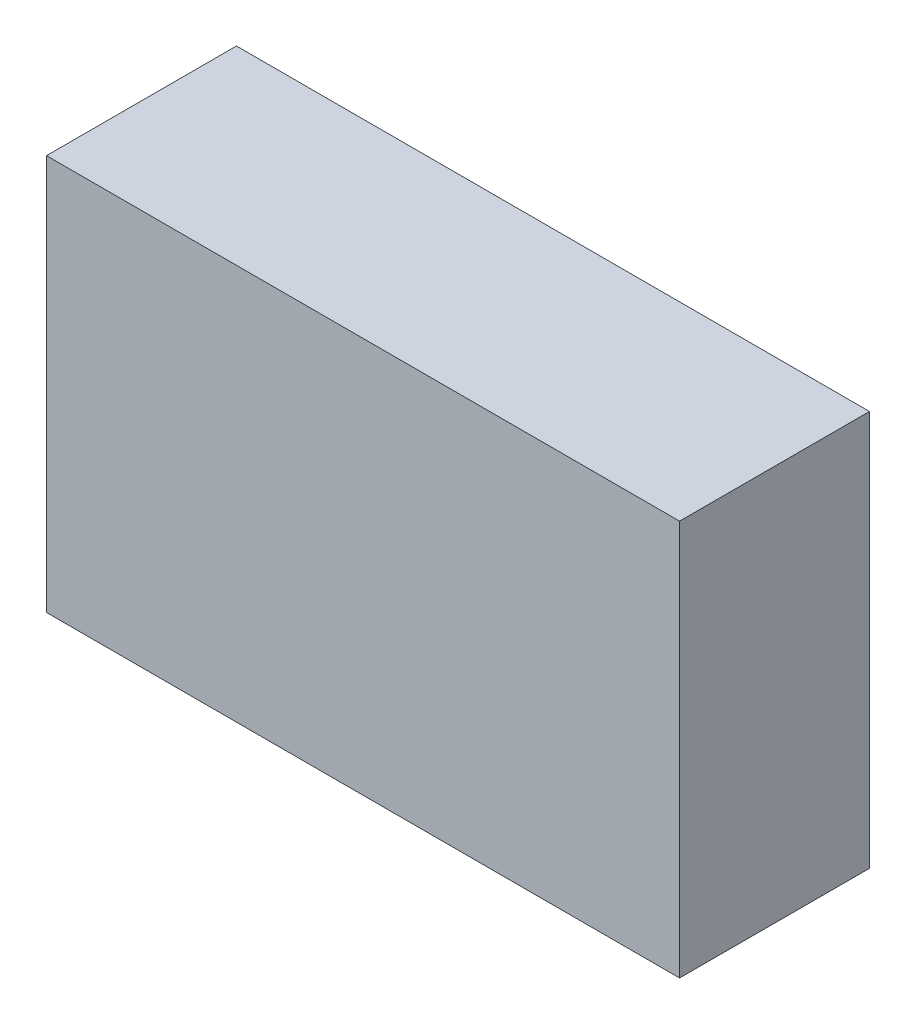
ISO-10303-21;
HEADER;
FILE_DESCRIPTION(('STEP AP214'),'2;1');
FILE_NAME('part.step','',(''),(''),'','','');
FILE_SCHEMA(('AUTOMOTIVE_DESIGN { 1 0 10303 214 1 1 1 1 }'));
ENDSEC;
DATA;
#1=APPLICATION_CONTEXT('core data for automotive mechanical design processes');
#2=APPLICATION_PROTOCOL_DEFINITION('international standard','automotive_design',2000,#1);
#3=PRODUCT_CONTEXT('',#1,'mechanical');
#4=PRODUCT('Part','Part','',(#3));
#5=PRODUCT_RELATED_PRODUCT_CATEGORY('part','',(#4));
#6=PRODUCT_DEFINITION_FORMATION('','',#4);
#7=PRODUCT_DEFINITION_CONTEXT('part definition',#1,'design');
#8=PRODUCT_DEFINITION('design','',#6,#7);
#9=PRODUCT_DEFINITION_SHAPE('','',#8);
#10=(LENGTH_UNIT() NAMED_UNIT(*) SI_UNIT(.MILLI.,.METRE.));
#11=(NAMED_UNIT(*) PLANE_ANGLE_UNIT() SI_UNIT($,.RADIAN.));
#12=(NAMED_UNIT(*) SI_UNIT($,.STERADIAN.) SOLID_ANGLE_UNIT());
#13=UNCERTAINTY_MEASURE_WITH_UNIT(LENGTH_MEASURE(1.E-05),#10,'distance_accuracy_value','');
#14=(GEOMETRIC_REPRESENTATION_CONTEXT(3) GLOBAL_UNCERTAINTY_ASSIGNED_CONTEXT((#13)) GLOBAL_UNIT_ASSIGNED_CONTEXT((#10,
#11,#12)) REPRESENTATION_CONTEXT('',''));
#15=CARTESIAN_POINT('',(0.,0.,0.));
#16=DIRECTION('',(0.,0.,1.));
#17=DIRECTION('',(1.,0.,0.));
#18=AXIS2_PLACEMENT_3D('',#15,#16,#17);
#19=CARTESIAN_POINT('',(-1.,0.625,0.6));
#20=DIRECTION('',(1.,0.,0.));
#21=DIRECTION('',(0.,0.,-1.));
#22=AXIS2_PLACEMENT_3D('',#19,#20,#21);
#23=PLANE('',#22);
#24=DIRECTION('',(0.,0.,1.));
#25=VECTOR('',#24,1.);
#26=CARTESIAN_POINT('',(-1.,-0.625,0.6));
#27=LINE('',#26,#25);
#28=CARTESIAN_POINT('',(-1.,-0.625,0.));
#29=VERTEX_POINT('',#28);
#30=CARTESIAN_POINT('',(-1.,-0.625,0.6));
#31=VERTEX_POINT('',#30);
#32=EDGE_CURVE('E68',#29,#31,#27,.T.);
#33=ORIENTED_EDGE('',*,*,#32,.T.);
#34=DIRECTION('',(0.,1.,0.));
#35=VECTOR('',#34,1.);
#36=CARTESIAN_POINT('',(-1.,0.,0.6));
#37=LINE('',#36,#35);
#38=CARTESIAN_POINT('',(-1.,0.625,0.6));
#39=VERTEX_POINT('',#38);
#40=EDGE_CURVE('E63',#39,#31,#37,.F.);
#41=ORIENTED_EDGE('',*,*,#40,.F.);
#42=DIRECTION('',(0.,0.,-1.));
#43=VECTOR('',#42,1.);
#44=CARTESIAN_POINT('',(-1.,0.625,0.6));
#45=LINE('',#44,#43);
#46=CARTESIAN_POINT('',(-1.,0.625,0.));
#47=VERTEX_POINT('',#46);
#48=EDGE_CURVE('E70',#39,#47,#45,.T.);
#49=ORIENTED_EDGE('',*,*,#48,.T.);
#50=DIRECTION('',(0.,1.,0.));
#51=VECTOR('',#50,1.);
#52=CARTESIAN_POINT('',(-1.,0.625,0.));
#53=LINE('',#52,#51);
#54=EDGE_CURVE('E19',#29,#47,#53,.T.);
#55=ORIENTED_EDGE('',*,*,#54,.F.);
#56=EDGE_LOOP('',(#33,#41,#49,#55));
#57=FACE_BOUND('',#56,.T.);
#58=ADVANCED_FACE('F16',(#57),#23,.F.);
#59=CARTESIAN_POINT('',(1.,-0.625,0.6));
#60=DIRECTION('',(-1.,0.,0.));
#61=DIRECTION('',(0.,0.,1.));
#62=AXIS2_PLACEMENT_3D('',#59,#60,#61);
#63=PLANE('',#62);
#64=DIRECTION('',(0.,0.,-1.));
#65=VECTOR('',#64,1.);
#66=CARTESIAN_POINT('',(1.,0.625,0.6));
#67=LINE('',#66,#65);
#68=CARTESIAN_POINT('',(1.,0.625,0.));
#69=VERTEX_POINT('',#68);
#70=CARTESIAN_POINT('',(1.,0.625,0.6));
#71=VERTEX_POINT('',#70);
#72=EDGE_CURVE('E76',#69,#71,#67,.F.);
#73=ORIENTED_EDGE('',*,*,#72,.T.);
#74=DIRECTION('',(0.,1.,0.));
#75=VECTOR('',#74,1.);
#76=CARTESIAN_POINT('',(1.,0.,0.6));
#77=LINE('',#76,#75);
#78=CARTESIAN_POINT('',(1.,-0.625,0.6));
#79=VERTEX_POINT('',#78);
#80=EDGE_CURVE('E62',#79,#71,#77,.T.);
#81=ORIENTED_EDGE('',*,*,#80,.F.);
#82=DIRECTION('',(0.,0.,1.));
#83=VECTOR('',#82,1.);
#84=CARTESIAN_POINT('',(1.,-0.625,0.6));
#85=LINE('',#84,#83);
#86=CARTESIAN_POINT('',(1.,-0.625,0.));
#87=VERTEX_POINT('',#86);
#88=EDGE_CURVE('E72',#87,#79,#85,.T.);
#89=ORIENTED_EDGE('',*,*,#88,.F.);
#90=DIRECTION('',(0.,1.,0.));
#91=VECTOR('',#90,1.);
#92=CARTESIAN_POINT('',(1.,-0.625,0.));
#93=LINE('',#92,#91);
#94=EDGE_CURVE('E60',#69,#87,#93,.F.);
#95=ORIENTED_EDGE('',*,*,#94,.F.);
#96=EDGE_LOOP('',(#73,#81,#89,#95));
#97=FACE_BOUND('',#96,.T.);
#98=ADVANCED_FACE('F87',(#97),#63,.F.);
#99=CARTESIAN_POINT('',(0.,0.,0.));
#100=DIRECTION('',(0.,0.,1.));
#101=DIRECTION('',(1.,0.,0.));
#102=AXIS2_PLACEMENT_3D('',#99,#100,#101);
#103=PLANE('',#102);
#104=DIRECTION('',(1.,0.,0.));
#105=VECTOR('',#104,1.);
#106=CARTESIAN_POINT('',(-1.,-0.625,0.));
#107=LINE('',#106,#105);
#108=EDGE_CURVE('E52',#87,#29,#107,.F.);
#109=ORIENTED_EDGE('',*,*,#108,.T.);
#110=ORIENTED_EDGE('',*,*,#54,.T.);
#111=DIRECTION('',(1.,0.,0.));
#112=VECTOR('',#111,1.);
#113=CARTESIAN_POINT('',(1.,0.625,0.));
#114=LINE('',#113,#112);
#115=EDGE_CURVE('E82',#47,#69,#114,.T.);
#116=ORIENTED_EDGE('',*,*,#115,.T.);
#117=ORIENTED_EDGE('',*,*,#94,.T.);
#118=EDGE_LOOP('',(#109,#110,#116,#117));
#119=FACE_BOUND('',#118,.T.);
#120=ADVANCED_FACE('F57',(#119),#103,.F.);
#121=CARTESIAN_POINT('',(-1.,-0.625,0.6));
#122=DIRECTION('',(0.,1.,0.));
#123=DIRECTION('',(0.,0.,1.));
#124=AXIS2_PLACEMENT_3D('',#121,#122,#123);
#125=PLANE('',#124);
#126=DIRECTION('',(1.,0.,0.));
#127=VECTOR('',#126,1.);
#128=CARTESIAN_POINT('',(0.,-0.625,0.6));
#129=LINE('',#128,#127);
#130=EDGE_CURVE('E25',#31,#79,#129,.T.);
#131=ORIENTED_EDGE('',*,*,#130,.F.);
#132=ORIENTED_EDGE('',*,*,#32,.F.);
#133=ORIENTED_EDGE('',*,*,#108,.F.);
#134=ORIENTED_EDGE('',*,*,#88,.T.);
#135=EDGE_LOOP('',(#131,#132,#133,#134));
#136=FACE_BOUND('',#135,.T.);
#137=ADVANCED_FACE('F71',(#136),#125,.F.);
#138=CARTESIAN_POINT('',(1.,0.625,0.6));
#139=DIRECTION('',(0.,-1.,0.));
#140=DIRECTION('',(0.,0.,-1.));
#141=AXIS2_PLACEMENT_3D('',#138,#139,#140);
#142=PLANE('',#141);
#143=ORIENTED_EDGE('',*,*,#115,.F.);
#144=ORIENTED_EDGE('',*,*,#48,.F.);
#145=DIRECTION('',(1.,0.,0.));
#146=VECTOR('',#145,1.);
#147=CARTESIAN_POINT('',(0.,0.625,0.6));
#148=LINE('',#147,#146);
#149=EDGE_CURVE('E10',#71,#39,#148,.F.);
#150=ORIENTED_EDGE('',*,*,#149,.F.);
#151=ORIENTED_EDGE('',*,*,#72,.F.);
#152=EDGE_LOOP('',(#143,#144,#150,#151));
#153=FACE_BOUND('',#152,.T.);
#154=ADVANCED_FACE('F89',(#153),#142,.F.);
#155=CARTESIAN_POINT('',(0.,0.,0.6));
#156=DIRECTION('',(0.,0.,1.));
#157=DIRECTION('',(1.,0.,0.));
#158=AXIS2_PLACEMENT_3D('',#155,#156,#157);
#159=PLANE('',#158);
#160=ORIENTED_EDGE('',*,*,#130,.T.);
#161=ORIENTED_EDGE('',*,*,#80,.T.);
#162=ORIENTED_EDGE('',*,*,#149,.T.);
#163=ORIENTED_EDGE('',*,*,#40,.T.);
#164=EDGE_LOOP('',(#160,#161,#162,#163));
#165=FACE_BOUND('',#164,.T.);
#166=ADVANCED_FACE('F90',(#165),#159,.T.);
#167=CLOSED_SHELL('',(#58,#98,#120,#137,#154,#166));
#168=MANIFOLD_SOLID_BREP('B1',#167);
#169=ADVANCED_BREP_SHAPE_REPRESENTATION('',(#18,#168),#14);
#170=SHAPE_DEFINITION_REPRESENTATION(#9,#169);
ENDSEC;
END-ISO-10303-21;
